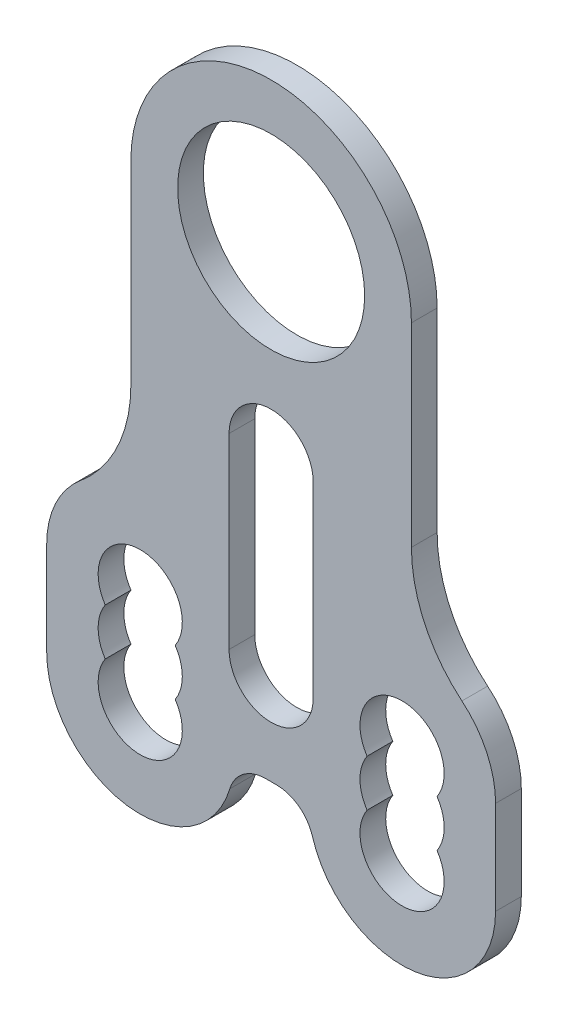
ISO-10303-21;
HEADER;
FILE_DESCRIPTION(('STEP AP214'),'2;1');
FILE_NAME('part.step','',(''),(''),'','','');
FILE_SCHEMA(('AUTOMOTIVE_DESIGN { 1 0 10303 214 1 1 1 1 }'));
ENDSEC;
DATA;
#1=APPLICATION_CONTEXT('core data for automotive mechanical design processes');
#2=APPLICATION_PROTOCOL_DEFINITION('international standard','automotive_design',2000,#1);
#3=PRODUCT_CONTEXT('',#1,'mechanical');
#4=PRODUCT('Part','Part','',(#3));
#5=PRODUCT_RELATED_PRODUCT_CATEGORY('part','',(#4));
#6=PRODUCT_DEFINITION_FORMATION('','',#4);
#7=PRODUCT_DEFINITION_CONTEXT('part definition',#1,'design');
#8=PRODUCT_DEFINITION('design','',#6,#7);
#9=PRODUCT_DEFINITION_SHAPE('','',#8);
#10=(LENGTH_UNIT() NAMED_UNIT(*) SI_UNIT(.MILLI.,.METRE.));
#11=(NAMED_UNIT(*) PLANE_ANGLE_UNIT() SI_UNIT($,.RADIAN.));
#12=(NAMED_UNIT(*) SI_UNIT($,.STERADIAN.) SOLID_ANGLE_UNIT());
#13=UNCERTAINTY_MEASURE_WITH_UNIT(LENGTH_MEASURE(1.E-05),#10,'distance_accuracy_value','');
#14=(GEOMETRIC_REPRESENTATION_CONTEXT(3) GLOBAL_UNCERTAINTY_ASSIGNED_CONTEXT((#13)) GLOBAL_UNIT_ASSIGNED_CONTEXT((#10,
#11,#12)) REPRESENTATION_CONTEXT('',''));
#15=CARTESIAN_POINT('',(0.,0.,0.));
#16=DIRECTION('',(0.,0.,1.));
#17=DIRECTION('',(1.,0.,0.));
#18=AXIS2_PLACEMENT_3D('',#15,#16,#17);
#19=CARTESIAN_POINT('',(0.583592135001261,-54.,2.75));
#20=DIRECTION('',(0.,0.,1.));
#21=DIRECTION('',(1.,0.,0.));
#22=AXIS2_PLACEMENT_3D('',#19,#20,#21);
#23=PLANE('',#22);
#24=CARTESIAN_POINT('',(0.583592135001261,-54.,2.75));
#25=DIRECTION('',(0.,0.,-1.));
#26=DIRECTION('',(1.,0.,0.));
#27=AXIS2_PLACEMENT_3D('',#24,#25,#26);
#28=CIRCLE('',#27,4.);
#29=CARTESIAN_POINT('',(0.583592135001261,-50.,2.75));
#30=VERTEX_POINT('',#29);
#31=CARTESIAN_POINT('',(4.4168515250009,-52.8571428571429,2.75));
#32=VERTEX_POINT('',#31);
#33=EDGE_CURVE('E314',#30,#32,#28,.T.);
#34=ORIENTED_EDGE('',*,*,#33,.T.);
#35=CARTESIAN_POINT('',(14.,-50.,2.75));
#36=DIRECTION('',(0.,0.,1.));
#37=DIRECTION('',(-1.,0.,0.));
#38=AXIS2_PLACEMENT_3D('',#35,#36,#37);
#39=CIRCLE('',#38,10.);
#40=CARTESIAN_POINT('',(24.,-50.0000000000001,2.75));
#41=VERTEX_POINT('',#40);
#42=EDGE_CURVE('E317',#32,#41,#39,.T.);
#43=ORIENTED_EDGE('',*,*,#42,.T.);
#44=DIRECTION('',(0.,1.,0.));
#45=VECTOR('',#44,1.);
#46=CARTESIAN_POINT('',(24.,-40.0000000000001,2.75));
#47=LINE('',#46,#45);
#48=CARTESIAN_POINT('',(24.,-40.0000000000001,2.75));
#49=VERTEX_POINT('',#48);
#50=EDGE_CURVE('E320',#41,#49,#47,.T.);
#51=ORIENTED_EDGE('',*,*,#50,.T.);
#52=CARTESIAN_POINT('',(14.,-40.,2.75));
#53=DIRECTION('',(0.,0.,1.));
#54=DIRECTION('',(-1.,0.,0.));
#55=AXIS2_PLACEMENT_3D('',#52,#53,#54);
#56=CIRCLE('',#55,10.);
#57=CARTESIAN_POINT('',(20.4,-32.3162509150806,2.75));
#58=VERTEX_POINT('',#57);
#59=EDGE_CURVE('E322',#49,#58,#56,.T.);
#60=ORIENTED_EDGE('',*,*,#59,.T.);
#61=CARTESIAN_POINT('',(30.,-20.7906272877015,2.75));
#62=DIRECTION('',(0.,0.,-1.));
#63=DIRECTION('',(-1.,0.,0.));
#64=AXIS2_PLACEMENT_3D('',#61,#62,#63);
#65=CIRCLE('',#64,15.);
#66=CARTESIAN_POINT('',(15.,-20.7906272877015,2.75));
#67=VERTEX_POINT('',#66);
#68=EDGE_CURVE('E324',#58,#67,#65,.T.);
#69=ORIENTED_EDGE('',*,*,#68,.T.);
#70=DIRECTION('',(0.,1.,0.));
#71=VECTOR('',#70,1.);
#72=CARTESIAN_POINT('',(15.,0.,2.75));
#73=LINE('',#72,#71);
#74=CARTESIAN_POINT('',(15.,0.,2.75));
#75=VERTEX_POINT('',#74);
#76=EDGE_CURVE('E326',#67,#75,#73,.T.);
#77=ORIENTED_EDGE('',*,*,#76,.T.);
#78=CARTESIAN_POINT('',(0.,0.,2.75));
#79=DIRECTION('',(0.,0.,1.));
#80=DIRECTION('',(1.,0.,0.));
#81=AXIS2_PLACEMENT_3D('',#78,#79,#80);
#82=CIRCLE('',#81,15.);
#83=CARTESIAN_POINT('',(-15.,0.,2.75));
#84=VERTEX_POINT('',#83);
#85=EDGE_CURVE('E328',#75,#84,#82,.T.);
#86=ORIENTED_EDGE('',*,*,#85,.T.);
#87=DIRECTION('',(0.,-1.,0.));
#88=VECTOR('',#87,1.);
#89=CARTESIAN_POINT('',(-15.,0.,2.75));
#90=LINE('',#89,#88);
#91=CARTESIAN_POINT('',(-15.,-20.7906272877015,2.75));
#92=VERTEX_POINT('',#91);
#93=EDGE_CURVE('E330',#84,#92,#90,.T.);
#94=ORIENTED_EDGE('',*,*,#93,.T.);
#95=CARTESIAN_POINT('',(-30.,-20.7906272877015,2.75));
#96=DIRECTION('',(0.,0.,-1.));
#97=DIRECTION('',(1.,0.,0.));
#98=AXIS2_PLACEMENT_3D('',#95,#96,#97);
#99=CIRCLE('',#98,15.);
#100=CARTESIAN_POINT('',(-20.4,-32.3162509150806,2.75));
#101=VERTEX_POINT('',#100);
#102=EDGE_CURVE('E332',#92,#101,#99,.T.);
#103=ORIENTED_EDGE('',*,*,#102,.T.);
#104=CARTESIAN_POINT('',(-14.,-40.,2.75));
#105=DIRECTION('',(0.,0.,1.));
#106=DIRECTION('',(1.,0.,0.));
#107=AXIS2_PLACEMENT_3D('',#104,#105,#106);
#108=CIRCLE('',#107,10.);
#109=CARTESIAN_POINT('',(-24.,-40.0000000000001,2.75));
#110=VERTEX_POINT('',#109);
#111=EDGE_CURVE('E334',#101,#110,#108,.T.);
#112=ORIENTED_EDGE('',*,*,#111,.T.);
#113=DIRECTION('',(0.,-1.,0.));
#114=VECTOR('',#113,1.);
#115=CARTESIAN_POINT('',(-24.,-40.0000000000001,2.75));
#116=LINE('',#115,#114);
#117=CARTESIAN_POINT('',(-24.,-50.0000000000001,2.75));
#118=VERTEX_POINT('',#117);
#119=EDGE_CURVE('E336',#110,#118,#116,.T.);
#120=ORIENTED_EDGE('',*,*,#119,.T.);
#121=CARTESIAN_POINT('',(-14.,-50.,2.75));
#122=DIRECTION('',(0.,0.,1.));
#123=DIRECTION('',(1.,0.,0.));
#124=AXIS2_PLACEMENT_3D('',#121,#122,#123);
#125=CIRCLE('',#124,10.);
#126=CARTESIAN_POINT('',(-4.4168515250009,-52.8571428571429,2.75));
#127=VERTEX_POINT('',#126);
#128=EDGE_CURVE('E338',#118,#127,#125,.T.);
#129=ORIENTED_EDGE('',*,*,#128,.T.);
#130=CARTESIAN_POINT('',(-0.583592135001261,-54.,2.75));
#131=DIRECTION('',(0.,0.,-1.));
#132=DIRECTION('',(-1.,0.,0.));
#133=AXIS2_PLACEMENT_3D('',#130,#131,#132);
#134=CIRCLE('',#133,4.);
#135=CARTESIAN_POINT('',(-0.583592135001261,-50.,2.75));
#136=VERTEX_POINT('',#135);
#137=EDGE_CURVE('E340',#127,#136,#134,.T.);
#138=ORIENTED_EDGE('',*,*,#137,.T.);
#139=DIRECTION('',(1.,0.,0.));
#140=VECTOR('',#139,1.);
#141=CARTESIAN_POINT('',(-0.583592135001261,-50.,2.75));
#142=LINE('',#141,#140);
#143=EDGE_CURVE('E342',#136,#30,#142,.T.);
#144=ORIENTED_EDGE('',*,*,#143,.T.);
#145=EDGE_LOOP('',(#34,#43,#51,#60,#69,#77,#86,#94,#103,#112,#120,#129,#138,#144));
#146=FACE_BOUND('',#145,.T.);
#147=CARTESIAN_POINT('',(0.,0.,2.75));
#148=DIRECTION('',(0.,0.,1.));
#149=DIRECTION('',(1.,0.,0.));
#150=AXIS2_PLACEMENT_3D('',#147,#148,#149);
#151=CIRCLE('',#150,10.);
#152=CARTESIAN_POINT('',(10.,0.,2.75));
#153=VERTEX_POINT('',#152);
#154=EDGE_CURVE('E308',#153,#153,#151,.T.);
#155=ORIENTED_EDGE('',*,*,#154,.F.);
#156=EDGE_LOOP('',(#155));
#157=FACE_BOUND('',#156,.T.);
#158=CARTESIAN_POINT('',(-14.,-40.,2.75));
#159=DIRECTION('',(0.,0.,1.));
#160=DIRECTION('',(1.,0.,0.));
#161=AXIS2_PLACEMENT_3D('',#158,#159,#160);
#162=CIRCLE('',#161,4.5);
#163=CARTESIAN_POINT('',(-10.2583426132261,-42.5,2.75));
#164=VERTEX_POINT('',#163);
#165=CARTESIAN_POINT('',(-17.7416573867739,-42.5,2.75));
#166=VERTEX_POINT('',#165);
#167=EDGE_CURVE('E279',#164,#166,#162,.T.);
#168=ORIENTED_EDGE('',*,*,#167,.F.);
#169=CARTESIAN_POINT('',(-14.,-45.,2.75));
#170=DIRECTION('',(0.,0.,1.));
#171=DIRECTION('',(1.,0.,0.));
#172=AXIS2_PLACEMENT_3D('',#169,#170,#171);
#173=CIRCLE('',#172,4.5);
#174=CARTESIAN_POINT('',(-10.2583426132261,-47.5,2.75));
#175=VERTEX_POINT('',#174);
#176=EDGE_CURVE('E277',#175,#164,#173,.T.);
#177=ORIENTED_EDGE('',*,*,#176,.F.);
#178=CARTESIAN_POINT('',(-14.,-50.,2.75));
#179=DIRECTION('',(0.,0.,1.));
#180=DIRECTION('',(1.,0.,0.));
#181=AXIS2_PLACEMENT_3D('',#178,#179,#180);
#182=CIRCLE('',#181,4.5);
#183=CARTESIAN_POINT('',(-17.7416573867739,-47.5,2.75));
#184=VERTEX_POINT('',#183);
#185=EDGE_CURVE('E285',#184,#175,#182,.T.);
#186=ORIENTED_EDGE('',*,*,#185,.F.);
#187=CARTESIAN_POINT('',(-14.,-45.,2.75));
#188=DIRECTION('',(0.,0.,1.));
#189=DIRECTION('',(1.,0.,0.));
#190=AXIS2_PLACEMENT_3D('',#187,#188,#189);
#191=CIRCLE('',#190,4.5);
#192=EDGE_CURVE('E282',#166,#184,#191,.T.);
#193=ORIENTED_EDGE('',*,*,#192,.F.);
#194=EDGE_LOOP('',(#168,#177,#186,#193));
#195=FACE_BOUND('',#194,.T.);
#196=CARTESIAN_POINT('',(14.,-45.,2.75));
#197=DIRECTION('',(0.,0.,1.));
#198=DIRECTION('',(-1.,0.,0.));
#199=AXIS2_PLACEMENT_3D('',#196,#197,#198);
#200=CIRCLE('',#199,4.5);
#201=CARTESIAN_POINT('',(17.7416573867739,-47.5,2.75));
#202=VERTEX_POINT('',#201);
#203=CARTESIAN_POINT('',(17.7416573867739,-42.5,2.75));
#204=VERTEX_POINT('',#203);
#205=EDGE_CURVE('E248',#202,#204,#200,.T.);
#206=ORIENTED_EDGE('',*,*,#205,.F.);
#207=CARTESIAN_POINT('',(14.,-50.,2.75));
#208=DIRECTION('',(0.,0.,1.));
#209=DIRECTION('',(-1.,0.,0.));
#210=AXIS2_PLACEMENT_3D('',#207,#208,#209);
#211=CIRCLE('',#210,4.5);
#212=CARTESIAN_POINT('',(10.2583426132261,-47.5,2.75));
#213=VERTEX_POINT('',#212);
#214=EDGE_CURVE('E246',#213,#202,#211,.T.);
#215=ORIENTED_EDGE('',*,*,#214,.F.);
#216=CARTESIAN_POINT('',(14.,-45.,2.75));
#217=DIRECTION('',(0.,0.,1.));
#218=DIRECTION('',(-1.,0.,0.));
#219=AXIS2_PLACEMENT_3D('',#216,#217,#218);
#220=CIRCLE('',#219,4.5);
#221=CARTESIAN_POINT('',(10.2583426132261,-42.5,2.75));
#222=VERTEX_POINT('',#221);
#223=EDGE_CURVE('E254',#222,#213,#220,.T.);
#224=ORIENTED_EDGE('',*,*,#223,.F.);
#225=CARTESIAN_POINT('',(14.,-40.,2.75));
#226=DIRECTION('',(0.,0.,1.));
#227=DIRECTION('',(-1.,0.,0.));
#228=AXIS2_PLACEMENT_3D('',#225,#226,#227);
#229=CIRCLE('',#228,4.5);
#230=EDGE_CURVE('E251',#204,#222,#229,.T.);
#231=ORIENTED_EDGE('',*,*,#230,.F.);
#232=EDGE_LOOP('',(#206,#215,#224,#231));
#233=FACE_BOUND('',#232,.T.);
#234=DIRECTION('',(0.,-1.,0.));
#235=VECTOR('',#234,1.);
#236=CARTESIAN_POINT('',(-4.5,-20.,2.75));
#237=LINE('',#236,#235);
#238=CARTESIAN_POINT('',(-4.5,-20.,2.75));
#239=VERTEX_POINT('',#238);
#240=CARTESIAN_POINT('',(-4.5,-40.,2.75));
#241=VERTEX_POINT('',#240);
#242=EDGE_CURVE('E218',#239,#241,#237,.T.);
#243=ORIENTED_EDGE('',*,*,#242,.F.);
#244=CARTESIAN_POINT('',(0.,-20.,2.75));
#245=DIRECTION('',(0.,0.,1.));
#246=DIRECTION('',(1.,0.,0.));
#247=AXIS2_PLACEMENT_3D('',#244,#245,#246);
#248=CIRCLE('',#247,4.5);
#249=CARTESIAN_POINT('',(4.5,-20.,2.75));
#250=VERTEX_POINT('',#249);
#251=EDGE_CURVE('E210',#250,#239,#248,.T.);
#252=ORIENTED_EDGE('',*,*,#251,.F.);
#253=DIRECTION('',(0.,1.,0.));
#254=VECTOR('',#253,1.);
#255=CARTESIAN_POINT('',(4.5,-20.,2.75));
#256=LINE('',#255,#254);
#257=CARTESIAN_POINT('',(4.5,-40.,2.75));
#258=VERTEX_POINT('',#257);
#259=EDGE_CURVE('E232',#258,#250,#256,.T.);
#260=ORIENTED_EDGE('',*,*,#259,.F.);
#261=CARTESIAN_POINT('',(0.,-40.,2.75));
#262=DIRECTION('',(0.,0.,1.));
#263=DIRECTION('',(1.,0.,0.));
#264=AXIS2_PLACEMENT_3D('',#261,#262,#263);
#265=CIRCLE('',#264,4.5);
#266=EDGE_CURVE('E230',#241,#258,#265,.T.);
#267=ORIENTED_EDGE('',*,*,#266,.F.);
#268=EDGE_LOOP('',(#243,#252,#260,#267));
#269=FACE_BOUND('',#268,.T.);
#270=ADVANCED_FACE('F37',(#146,#157,#195,#233,#269),#23,.T.);
#271=CARTESIAN_POINT('',(0.583592135001261,-54.,0.));
#272=DIRECTION('',(0.,0.,1.));
#273=DIRECTION('',(1.,0.,0.));
#274=AXIS2_PLACEMENT_3D('',#271,#272,#273);
#275=PLANE('',#274);
#276=CARTESIAN_POINT('',(14.,-50.,0.));
#277=DIRECTION('',(0.,0.,1.));
#278=DIRECTION('',(-1.,0.,0.));
#279=AXIS2_PLACEMENT_3D('',#276,#277,#278);
#280=CIRCLE('',#279,4.5);
#281=CARTESIAN_POINT('',(10.2583426132261,-47.5,0.));
#282=VERTEX_POINT('',#281);
#283=CARTESIAN_POINT('',(17.7416573867739,-47.5,0.));
#284=VERTEX_POINT('',#283);
#285=EDGE_CURVE('E226',#282,#284,#280,.T.);
#286=ORIENTED_EDGE('',*,*,#285,.T.);
#287=CARTESIAN_POINT('',(14.,-45.,0.));
#288=DIRECTION('',(0.,0.,1.));
#289=DIRECTION('',(-1.,0.,0.));
#290=AXIS2_PLACEMENT_3D('',#287,#288,#289);
#291=CIRCLE('',#290,4.5);
#292=CARTESIAN_POINT('',(17.7416573867739,-42.5,0.));
#293=VERTEX_POINT('',#292);
#294=EDGE_CURVE('E259',#284,#293,#291,.T.);
#295=ORIENTED_EDGE('',*,*,#294,.T.);
#296=CARTESIAN_POINT('',(14.,-40.,0.));
#297=DIRECTION('',(0.,0.,1.));
#298=DIRECTION('',(-1.,0.,0.));
#299=AXIS2_PLACEMENT_3D('',#296,#297,#298);
#300=CIRCLE('',#299,4.5);
#301=CARTESIAN_POINT('',(10.2583426132261,-42.5,0.));
#302=VERTEX_POINT('',#301);
#303=EDGE_CURVE('E262',#293,#302,#300,.T.);
#304=ORIENTED_EDGE('',*,*,#303,.T.);
#305=CARTESIAN_POINT('',(14.,-45.,0.));
#306=DIRECTION('',(0.,0.,1.));
#307=DIRECTION('',(-1.,0.,0.));
#308=AXIS2_PLACEMENT_3D('',#305,#306,#307);
#309=CIRCLE('',#308,4.5);
#310=EDGE_CURVE('E249',#302,#282,#309,.T.);
#311=ORIENTED_EDGE('',*,*,#310,.T.);
#312=EDGE_LOOP('',(#286,#295,#304,#311));
#313=FACE_BOUND('',#312,.T.);
#314=CARTESIAN_POINT('',(0.,0.,0.));
#315=DIRECTION('',(0.,0.,1.));
#316=DIRECTION('',(1.,0.,0.));
#317=AXIS2_PLACEMENT_3D('',#314,#315,#316);
#318=CIRCLE('',#317,10.);
#319=CARTESIAN_POINT('',(10.,0.,0.));
#320=VERTEX_POINT('',#319);
#321=EDGE_CURVE('E307',#320,#320,#318,.T.);
#322=ORIENTED_EDGE('',*,*,#321,.T.);
#323=EDGE_LOOP('',(#322));
#324=FACE_BOUND('',#323,.T.);
#325=CARTESIAN_POINT('',(0.583592135001261,-54.,0.));
#326=DIRECTION('',(0.,0.,-1.));
#327=DIRECTION('',(1.,0.,0.));
#328=AXIS2_PLACEMENT_3D('',#325,#326,#327);
#329=CIRCLE('',#328,4.);
#330=CARTESIAN_POINT('',(0.583592135001261,-50.,0.));
#331=VERTEX_POINT('',#330);
#332=CARTESIAN_POINT('',(4.4168515250009,-52.8571428571429,0.));
#333=VERTEX_POINT('',#332);
#334=EDGE_CURVE('E311',#331,#333,#329,.T.);
#335=ORIENTED_EDGE('',*,*,#334,.F.);
#336=DIRECTION('',(1.,0.,0.));
#337=VECTOR('',#336,1.);
#338=CARTESIAN_POINT('',(-0.583592135001261,-50.,0.));
#339=LINE('',#338,#337);
#340=CARTESIAN_POINT('',(-0.583592135001261,-50.,0.));
#341=VERTEX_POINT('',#340);
#342=EDGE_CURVE('E318',#341,#331,#339,.T.);
#343=ORIENTED_EDGE('',*,*,#342,.F.);
#344=CARTESIAN_POINT('',(-0.583592135001261,-54.,0.));
#345=DIRECTION('',(0.,0.,-1.));
#346=DIRECTION('',(-1.,0.,0.));
#347=AXIS2_PLACEMENT_3D('',#344,#345,#346);
#348=CIRCLE('',#347,4.);
#349=CARTESIAN_POINT('',(-4.4168515250009,-52.8571428571429,0.));
#350=VERTEX_POINT('',#349);
#351=EDGE_CURVE('E369',#350,#341,#348,.T.);
#352=ORIENTED_EDGE('',*,*,#351,.F.);
#353=CARTESIAN_POINT('',(-14.,-50.,0.));
#354=DIRECTION('',(0.,0.,1.));
#355=DIRECTION('',(1.,0.,0.));
#356=AXIS2_PLACEMENT_3D('',#353,#354,#355);
#357=CIRCLE('',#356,10.);
#358=CARTESIAN_POINT('',(-24.,-50.0000000000001,0.));
#359=VERTEX_POINT('',#358);
#360=EDGE_CURVE('E367',#359,#350,#357,.T.);
#361=ORIENTED_EDGE('',*,*,#360,.F.);
#362=DIRECTION('',(0.,-1.,0.));
#363=VECTOR('',#362,1.);
#364=CARTESIAN_POINT('',(-24.,-40.0000000000001,0.));
#365=LINE('',#364,#363);
#366=CARTESIAN_POINT('',(-24.,-40.0000000000001,0.));
#367=VERTEX_POINT('',#366);
#368=EDGE_CURVE('E365',#367,#359,#365,.T.);
#369=ORIENTED_EDGE('',*,*,#368,.F.);
#370=CARTESIAN_POINT('',(-14.,-40.,0.));
#371=DIRECTION('',(0.,0.,1.));
#372=DIRECTION('',(1.,0.,0.));
#373=AXIS2_PLACEMENT_3D('',#370,#371,#372);
#374=CIRCLE('',#373,10.);
#375=CARTESIAN_POINT('',(-20.4,-32.3162509150806,0.));
#376=VERTEX_POINT('',#375);
#377=EDGE_CURVE('E363',#376,#367,#374,.T.);
#378=ORIENTED_EDGE('',*,*,#377,.F.);
#379=CARTESIAN_POINT('',(-30.,-20.7906272877015,0.));
#380=DIRECTION('',(0.,0.,-1.));
#381=DIRECTION('',(1.,0.,0.));
#382=AXIS2_PLACEMENT_3D('',#379,#380,#381);
#383=CIRCLE('',#382,15.);
#384=CARTESIAN_POINT('',(-15.,-20.7906272877015,0.));
#385=VERTEX_POINT('',#384);
#386=EDGE_CURVE('E361',#385,#376,#383,.T.);
#387=ORIENTED_EDGE('',*,*,#386,.F.);
#388=DIRECTION('',(0.,-1.,0.));
#389=VECTOR('',#388,1.);
#390=CARTESIAN_POINT('',(-15.,0.,0.));
#391=LINE('',#390,#389);
#392=CARTESIAN_POINT('',(-15.,0.,0.));
#393=VERTEX_POINT('',#392);
#394=EDGE_CURVE('E359',#393,#385,#391,.T.);
#395=ORIENTED_EDGE('',*,*,#394,.F.);
#396=CARTESIAN_POINT('',(0.,0.,0.));
#397=DIRECTION('',(0.,0.,1.));
#398=DIRECTION('',(1.,0.,0.));
#399=AXIS2_PLACEMENT_3D('',#396,#397,#398);
#400=CIRCLE('',#399,15.);
#401=CARTESIAN_POINT('',(15.,0.,0.));
#402=VERTEX_POINT('',#401);
#403=EDGE_CURVE('E357',#402,#393,#400,.T.);
#404=ORIENTED_EDGE('',*,*,#403,.F.);
#405=DIRECTION('',(0.,1.,0.));
#406=VECTOR('',#405,1.);
#407=CARTESIAN_POINT('',(15.,0.,0.));
#408=LINE('',#407,#406);
#409=CARTESIAN_POINT('',(15.,-20.7906272877015,0.));
#410=VERTEX_POINT('',#409);
#411=EDGE_CURVE('E355',#410,#402,#408,.T.);
#412=ORIENTED_EDGE('',*,*,#411,.F.);
#413=CARTESIAN_POINT('',(30.,-20.7906272877015,0.));
#414=DIRECTION('',(0.,0.,-1.));
#415=DIRECTION('',(-1.,0.,0.));
#416=AXIS2_PLACEMENT_3D('',#413,#414,#415);
#417=CIRCLE('',#416,15.);
#418=CARTESIAN_POINT('',(20.4,-32.3162509150806,0.));
#419=VERTEX_POINT('',#418);
#420=EDGE_CURVE('E353',#419,#410,#417,.T.);
#421=ORIENTED_EDGE('',*,*,#420,.F.);
#422=CARTESIAN_POINT('',(14.,-40.,0.));
#423=DIRECTION('',(0.,0.,1.));
#424=DIRECTION('',(-1.,0.,0.));
#425=AXIS2_PLACEMENT_3D('',#422,#423,#424);
#426=CIRCLE('',#425,10.);
#427=CARTESIAN_POINT('',(24.,-40.0000000000001,0.));
#428=VERTEX_POINT('',#427);
#429=EDGE_CURVE('E351',#428,#419,#426,.T.);
#430=ORIENTED_EDGE('',*,*,#429,.F.);
#431=DIRECTION('',(0.,1.,0.));
#432=VECTOR('',#431,1.);
#433=CARTESIAN_POINT('',(24.,-40.0000000000001,0.));
#434=LINE('',#433,#432);
#435=CARTESIAN_POINT('',(24.,-50.0000000000001,0.));
#436=VERTEX_POINT('',#435);
#437=EDGE_CURVE('E349',#436,#428,#434,.T.);
#438=ORIENTED_EDGE('',*,*,#437,.F.);
#439=CARTESIAN_POINT('',(14.,-50.,0.));
#440=DIRECTION('',(0.,0.,1.));
#441=DIRECTION('',(-1.,0.,0.));
#442=AXIS2_PLACEMENT_3D('',#439,#440,#441);
#443=CIRCLE('',#442,10.);
#444=EDGE_CURVE('E347',#333,#436,#443,.T.);
#445=ORIENTED_EDGE('',*,*,#444,.F.);
#446=EDGE_LOOP('',(#335,#343,#352,#361,#369,#378,#387,#395,#404,#412,#421,#430,#438,#445));
#447=FACE_BOUND('',#446,.T.);
#448=CARTESIAN_POINT('',(-14.,-45.,0.));
#449=DIRECTION('',(0.,0.,1.));
#450=DIRECTION('',(1.,0.,0.));
#451=AXIS2_PLACEMENT_3D('',#448,#449,#450);
#452=CIRCLE('',#451,4.5);
#453=CARTESIAN_POINT('',(-10.2583426132261,-47.5,0.));
#454=VERTEX_POINT('',#453);
#455=CARTESIAN_POINT('',(-10.2583426132261,-42.5,0.));
#456=VERTEX_POINT('',#455);
#457=EDGE_CURVE('E276',#454,#456,#452,.T.);
#458=ORIENTED_EDGE('',*,*,#457,.T.);
#459=CARTESIAN_POINT('',(-14.,-40.,0.));
#460=DIRECTION('',(0.,0.,1.));
#461=DIRECTION('',(1.,0.,0.));
#462=AXIS2_PLACEMENT_3D('',#459,#460,#461);
#463=CIRCLE('',#462,4.5);
#464=CARTESIAN_POINT('',(-17.7416573867739,-42.5,0.));
#465=VERTEX_POINT('',#464);
#466=EDGE_CURVE('E290',#456,#465,#463,.T.);
#467=ORIENTED_EDGE('',*,*,#466,.T.);
#468=CARTESIAN_POINT('',(-14.,-45.,0.));
#469=DIRECTION('',(0.,0.,1.));
#470=DIRECTION('',(1.,0.,0.));
#471=AXIS2_PLACEMENT_3D('',#468,#469,#470);
#472=CIRCLE('',#471,4.5);
#473=CARTESIAN_POINT('',(-17.7416573867739,-47.5,0.));
#474=VERTEX_POINT('',#473);
#475=EDGE_CURVE('E293',#465,#474,#472,.T.);
#476=ORIENTED_EDGE('',*,*,#475,.T.);
#477=CARTESIAN_POINT('',(-14.,-50.,0.));
#478=DIRECTION('',(0.,0.,1.));
#479=DIRECTION('',(1.,0.,0.));
#480=AXIS2_PLACEMENT_3D('',#477,#478,#479);
#481=CIRCLE('',#480,4.5);
#482=EDGE_CURVE('E280',#474,#454,#481,.T.);
#483=ORIENTED_EDGE('',*,*,#482,.T.);
#484=EDGE_LOOP('',(#458,#467,#476,#483));
#485=FACE_BOUND('',#484,.T.);
#486=CARTESIAN_POINT('',(0.,-20.,0.));
#487=DIRECTION('',(0.,0.,1.));
#488=DIRECTION('',(1.,0.,0.));
#489=AXIS2_PLACEMENT_3D('',#486,#487,#488);
#490=CIRCLE('',#489,4.5);
#491=CARTESIAN_POINT('',(4.5,-20.,0.));
#492=VERTEX_POINT('',#491);
#493=CARTESIAN_POINT('',(-4.5,-20.,0.));
#494=VERTEX_POINT('',#493);
#495=EDGE_CURVE('E60',#492,#494,#490,.T.);
#496=ORIENTED_EDGE('',*,*,#495,.T.);
#497=DIRECTION('',(0.,-1.,0.));
#498=VECTOR('',#497,1.);
#499=CARTESIAN_POINT('',(-4.5,-20.,0.));
#500=LINE('',#499,#498);
#501=CARTESIAN_POINT('',(-4.5,-40.,0.));
#502=VERTEX_POINT('',#501);
#503=EDGE_CURVE('E225',#494,#502,#500,.T.);
#504=ORIENTED_EDGE('',*,*,#503,.T.);
#505=CARTESIAN_POINT('',(0.,-40.,0.));
#506=DIRECTION('',(0.,0.,1.));
#507=DIRECTION('',(1.,0.,0.));
#508=AXIS2_PLACEMENT_3D('',#505,#506,#507);
#509=CIRCLE('',#508,4.5);
#510=CARTESIAN_POINT('',(4.5,-40.,0.));
#511=VERTEX_POINT('',#510);
#512=EDGE_CURVE('E238',#502,#511,#509,.T.);
#513=ORIENTED_EDGE('',*,*,#512,.T.);
#514=DIRECTION('',(0.,1.,0.));
#515=VECTOR('',#514,1.);
#516=CARTESIAN_POINT('',(4.5,-20.,0.));
#517=LINE('',#516,#515);
#518=EDGE_CURVE('E219',#511,#492,#517,.T.);
#519=ORIENTED_EDGE('',*,*,#518,.T.);
#520=EDGE_LOOP('',(#496,#504,#513,#519));
#521=FACE_BOUND('',#520,.T.);
#522=ADVANCED_FACE('F417',(#313,#324,#447,#485,#521),#275,.F.);
#523=CARTESIAN_POINT('',(0.583592135001261,-54.,2.75));
#524=DIRECTION('',(0.,0.,-1.));
#525=DIRECTION('',(-1.,0.,0.));
#526=AXIS2_PLACEMENT_3D('',#523,#524,#525);
#527=CYLINDRICAL_SURFACE('',#526,4.);
#528=ORIENTED_EDGE('',*,*,#334,.T.);
#529=DIRECTION('',(0.,0.,-1.));
#530=VECTOR('',#529,1.);
#531=CARTESIAN_POINT('',(4.4168515250009,-52.8571428571429,2.75));
#532=LINE('',#531,#530);
#533=EDGE_CURVE('E11',#32,#333,#532,.T.);
#534=ORIENTED_EDGE('',*,*,#533,.F.);
#535=ORIENTED_EDGE('',*,*,#33,.F.);
#536=DIRECTION('',(0.,0.,-1.));
#537=VECTOR('',#536,1.);
#538=CARTESIAN_POINT('',(0.583592135001261,-50.,2.75));
#539=LINE('',#538,#537);
#540=EDGE_CURVE('E344',#30,#331,#539,.T.);
#541=ORIENTED_EDGE('',*,*,#540,.T.);
#542=EDGE_LOOP('',(#528,#534,#535,#541));
#543=FACE_BOUND('',#542,.T.);
#544=ADVANCED_FACE('F39',(#543),#527,.F.);
#545=CARTESIAN_POINT('',(14.,-50.,2.75));
#546=DIRECTION('',(0.,0.,-1.));
#547=DIRECTION('',(-1.,0.,0.));
#548=AXIS2_PLACEMENT_3D('',#545,#546,#547);
#549=CYLINDRICAL_SURFACE('',#548,10.);
#550=ORIENTED_EDGE('',*,*,#444,.T.);
#551=DIRECTION('',(0.,0.,-1.));
#552=VECTOR('',#551,1.);
#553=CARTESIAN_POINT('',(24.,-50.0000000000001,2.75));
#554=LINE('',#553,#552);
#555=EDGE_CURVE('E45',#41,#436,#554,.T.);
#556=ORIENTED_EDGE('',*,*,#555,.F.);
#557=ORIENTED_EDGE('',*,*,#42,.F.);
#558=ORIENTED_EDGE('',*,*,#533,.T.);
#559=EDGE_LOOP('',(#550,#556,#557,#558));
#560=FACE_BOUND('',#559,.T.);
#561=ADVANCED_FACE('F435',(#560),#549,.T.);
#562=CARTESIAN_POINT('',(24.,-40.0000000000001,2.75));
#563=DIRECTION('',(-1.,0.,0.));
#564=DIRECTION('',(0.,0.,1.));
#565=AXIS2_PLACEMENT_3D('',#562,#563,#564);
#566=PLANE('',#565);
#567=ORIENTED_EDGE('',*,*,#437,.T.);
#568=DIRECTION('',(0.,0.,-1.));
#569=VECTOR('',#568,1.);
#570=CARTESIAN_POINT('',(24.,-40.0000000000001,2.75));
#571=LINE('',#570,#569);
#572=EDGE_CURVE('E404',#49,#428,#571,.T.);
#573=ORIENTED_EDGE('',*,*,#572,.F.);
#574=ORIENTED_EDGE('',*,*,#50,.F.);
#575=ORIENTED_EDGE('',*,*,#555,.T.);
#576=EDGE_LOOP('',(#567,#573,#574,#575));
#577=FACE_BOUND('',#576,.T.);
#578=ADVANCED_FACE('F411',(#577),#566,.F.);
#579=CARTESIAN_POINT('',(14.,-40.,2.75));
#580=DIRECTION('',(0.,0.,-1.));
#581=DIRECTION('',(-1.,0.,0.));
#582=AXIS2_PLACEMENT_3D('',#579,#580,#581);
#583=CYLINDRICAL_SURFACE('',#582,10.);
#584=ORIENTED_EDGE('',*,*,#429,.T.);
#585=DIRECTION('',(0.,0.,-1.));
#586=VECTOR('',#585,1.);
#587=CARTESIAN_POINT('',(20.4,-32.3162509150806,2.75));
#588=LINE('',#587,#586);
#589=EDGE_CURVE('E401',#58,#419,#588,.T.);
#590=ORIENTED_EDGE('',*,*,#589,.F.);
#591=ORIENTED_EDGE('',*,*,#59,.F.);
#592=ORIENTED_EDGE('',*,*,#572,.T.);
#593=EDGE_LOOP('',(#584,#590,#591,#592));
#594=FACE_BOUND('',#593,.T.);
#595=ADVANCED_FACE('F423',(#594),#583,.T.);
#596=CARTESIAN_POINT('',(30.,-20.7906272877015,2.75));
#597=DIRECTION('',(0.,0.,-1.));
#598=DIRECTION('',(-1.,0.,0.));
#599=AXIS2_PLACEMENT_3D('',#596,#597,#598);
#600=CYLINDRICAL_SURFACE('',#599,15.);
#601=ORIENTED_EDGE('',*,*,#420,.T.);
#602=DIRECTION('',(0.,0.,-1.));
#603=VECTOR('',#602,1.);
#604=CARTESIAN_POINT('',(15.,-20.7906272877015,2.75));
#605=LINE('',#604,#603);
#606=EDGE_CURVE('E398',#67,#410,#605,.T.);
#607=ORIENTED_EDGE('',*,*,#606,.F.);
#608=ORIENTED_EDGE('',*,*,#68,.F.);
#609=ORIENTED_EDGE('',*,*,#589,.T.);
#610=EDGE_LOOP('',(#601,#607,#608,#609));
#611=FACE_BOUND('',#610,.T.);
#612=ADVANCED_FACE('F427',(#611),#600,.F.);
#613=CARTESIAN_POINT('',(15.,0.,2.75));
#614=DIRECTION('',(-1.,0.,0.));
#615=DIRECTION('',(0.,0.,1.));
#616=AXIS2_PLACEMENT_3D('',#613,#614,#615);
#617=PLANE('',#616);
#618=ORIENTED_EDGE('',*,*,#411,.T.);
#619=DIRECTION('',(0.,0.,-1.));
#620=VECTOR('',#619,1.);
#621=CARTESIAN_POINT('',(15.,0.,2.75));
#622=LINE('',#621,#620);
#623=EDGE_CURVE('E395',#75,#402,#622,.T.);
#624=ORIENTED_EDGE('',*,*,#623,.F.);
#625=ORIENTED_EDGE('',*,*,#76,.F.);
#626=ORIENTED_EDGE('',*,*,#606,.T.);
#627=EDGE_LOOP('',(#618,#624,#625,#626));
#628=FACE_BOUND('',#627,.T.);
#629=ADVANCED_FACE('F478',(#628),#617,.F.);
#630=CARTESIAN_POINT('',(0.,0.,2.75));
#631=DIRECTION('',(0.,0.,-1.));
#632=DIRECTION('',(-1.,0.,0.));
#633=AXIS2_PLACEMENT_3D('',#630,#631,#632);
#634=CYLINDRICAL_SURFACE('',#633,15.);
#635=ORIENTED_EDGE('',*,*,#403,.T.);
#636=DIRECTION('',(0.,0.,-1.));
#637=VECTOR('',#636,1.);
#638=CARTESIAN_POINT('',(-15.,0.,2.75));
#639=LINE('',#638,#637);
#640=EDGE_CURVE('E392',#84,#393,#639,.T.);
#641=ORIENTED_EDGE('',*,*,#640,.F.);
#642=ORIENTED_EDGE('',*,*,#85,.F.);
#643=ORIENTED_EDGE('',*,*,#623,.T.);
#644=EDGE_LOOP('',(#635,#641,#642,#643));
#645=FACE_BOUND('',#644,.T.);
#646=ADVANCED_FACE('F476',(#645),#634,.T.);
#647=CARTESIAN_POINT('',(-15.,0.,2.75));
#648=DIRECTION('',(1.,0.,0.));
#649=DIRECTION('',(0.,0.,-1.));
#650=AXIS2_PLACEMENT_3D('',#647,#648,#649);
#651=PLANE('',#650);
#652=ORIENTED_EDGE('',*,*,#394,.T.);
#653=DIRECTION('',(0.,0.,-1.));
#654=VECTOR('',#653,1.);
#655=CARTESIAN_POINT('',(-15.,-20.7906272877015,2.75));
#656=LINE('',#655,#654);
#657=EDGE_CURVE('E389',#92,#385,#656,.T.);
#658=ORIENTED_EDGE('',*,*,#657,.F.);
#659=ORIENTED_EDGE('',*,*,#93,.F.);
#660=ORIENTED_EDGE('',*,*,#640,.T.);
#661=EDGE_LOOP('',(#652,#658,#659,#660));
#662=FACE_BOUND('',#661,.T.);
#663=ADVANCED_FACE('F471',(#662),#651,.F.);
#664=CARTESIAN_POINT('',(-30.,-20.7906272877015,2.75));
#665=DIRECTION('',(0.,0.,-1.));
#666=DIRECTION('',(-1.,0.,0.));
#667=AXIS2_PLACEMENT_3D('',#664,#665,#666);
#668=CYLINDRICAL_SURFACE('',#667,15.);
#669=ORIENTED_EDGE('',*,*,#386,.T.);
#670=DIRECTION('',(0.,0.,-1.));
#671=VECTOR('',#670,1.);
#672=CARTESIAN_POINT('',(-20.4,-32.3162509150806,2.75));
#673=LINE('',#672,#671);
#674=EDGE_CURVE('E386',#101,#376,#673,.T.);
#675=ORIENTED_EDGE('',*,*,#674,.F.);
#676=ORIENTED_EDGE('',*,*,#102,.F.);
#677=ORIENTED_EDGE('',*,*,#657,.T.);
#678=EDGE_LOOP('',(#669,#675,#676,#677));
#679=FACE_BOUND('',#678,.T.);
#680=ADVANCED_FACE('F466',(#679),#668,.F.);
#681=CARTESIAN_POINT('',(-14.,-40.,2.75));
#682=DIRECTION('',(0.,0.,-1.));
#683=DIRECTION('',(-1.,0.,0.));
#684=AXIS2_PLACEMENT_3D('',#681,#682,#683);
#685=CYLINDRICAL_SURFACE('',#684,10.);
#686=ORIENTED_EDGE('',*,*,#377,.T.);
#687=DIRECTION('',(0.,0.,-1.));
#688=VECTOR('',#687,1.);
#689=CARTESIAN_POINT('',(-24.,-40.0000000000001,2.75));
#690=LINE('',#689,#688);
#691=EDGE_CURVE('E383',#110,#367,#690,.T.);
#692=ORIENTED_EDGE('',*,*,#691,.F.);
#693=ORIENTED_EDGE('',*,*,#111,.F.);
#694=ORIENTED_EDGE('',*,*,#674,.T.);
#695=EDGE_LOOP('',(#686,#692,#693,#694));
#696=FACE_BOUND('',#695,.T.);
#697=ADVANCED_FACE('F462',(#696),#685,.T.);
#698=CARTESIAN_POINT('',(-24.,-40.0000000000001,2.75));
#699=DIRECTION('',(1.,0.,0.));
#700=DIRECTION('',(0.,0.,-1.));
#701=AXIS2_PLACEMENT_3D('',#698,#699,#700);
#702=PLANE('',#701);
#703=ORIENTED_EDGE('',*,*,#368,.T.);
#704=DIRECTION('',(0.,0.,-1.));
#705=VECTOR('',#704,1.);
#706=CARTESIAN_POINT('',(-24.,-50.0000000000001,2.75));
#707=LINE('',#706,#705);
#708=EDGE_CURVE('E380',#118,#359,#707,.T.);
#709=ORIENTED_EDGE('',*,*,#708,.F.);
#710=ORIENTED_EDGE('',*,*,#119,.F.);
#711=ORIENTED_EDGE('',*,*,#691,.T.);
#712=EDGE_LOOP('',(#703,#709,#710,#711));
#713=FACE_BOUND('',#712,.T.);
#714=ADVANCED_FACE('F457',(#713),#702,.F.);
#715=CARTESIAN_POINT('',(-14.,-50.,2.75));
#716=DIRECTION('',(0.,0.,-1.));
#717=DIRECTION('',(-1.,0.,0.));
#718=AXIS2_PLACEMENT_3D('',#715,#716,#717);
#719=CYLINDRICAL_SURFACE('',#718,10.);
#720=ORIENTED_EDGE('',*,*,#360,.T.);
#721=DIRECTION('',(0.,0.,-1.));
#722=VECTOR('',#721,1.);
#723=CARTESIAN_POINT('',(-4.4168515250009,-52.8571428571429,2.75));
#724=LINE('',#723,#722);
#725=EDGE_CURVE('E377',#127,#350,#724,.T.);
#726=ORIENTED_EDGE('',*,*,#725,.F.);
#727=ORIENTED_EDGE('',*,*,#128,.F.);
#728=ORIENTED_EDGE('',*,*,#708,.T.);
#729=EDGE_LOOP('',(#720,#726,#727,#728));
#730=FACE_BOUND('',#729,.T.);
#731=ADVANCED_FACE('F451',(#730),#719,.T.);
#732=CARTESIAN_POINT('',(-0.583592135001261,-54.,2.75));
#733=DIRECTION('',(0.,0.,-1.));
#734=DIRECTION('',(-1.,0.,0.));
#735=AXIS2_PLACEMENT_3D('',#732,#733,#734);
#736=CYLINDRICAL_SURFACE('',#735,4.);
#737=ORIENTED_EDGE('',*,*,#351,.T.);
#738=DIRECTION('',(0.,0.,-1.));
#739=VECTOR('',#738,1.);
#740=CARTESIAN_POINT('',(-0.583592135001261,-50.,2.75));
#741=LINE('',#740,#739);
#742=EDGE_CURVE('E374',#136,#341,#741,.T.);
#743=ORIENTED_EDGE('',*,*,#742,.F.);
#744=ORIENTED_EDGE('',*,*,#137,.F.);
#745=ORIENTED_EDGE('',*,*,#725,.T.);
#746=EDGE_LOOP('',(#737,#743,#744,#745));
#747=FACE_BOUND('',#746,.T.);
#748=ADVANCED_FACE('F447',(#747),#736,.F.);
#749=CARTESIAN_POINT('',(-0.583592135001261,-50.,2.75));
#750=DIRECTION('',(0.,1.,0.));
#751=DIRECTION('',(0.,0.,1.));
#752=AXIS2_PLACEMENT_3D('',#749,#750,#751);
#753=PLANE('',#752);
#754=ORIENTED_EDGE('',*,*,#342,.T.);
#755=ORIENTED_EDGE('',*,*,#540,.F.);
#756=ORIENTED_EDGE('',*,*,#143,.F.);
#757=ORIENTED_EDGE('',*,*,#742,.T.);
#758=EDGE_LOOP('',(#754,#755,#756,#757));
#759=FACE_BOUND('',#758,.T.);
#760=ADVANCED_FACE('F442',(#759),#753,.F.);
#761=CARTESIAN_POINT('',(0.,0.,2.75));
#762=DIRECTION('',(0.,0.,-1.));
#763=DIRECTION('',(-1.,0.,0.));
#764=AXIS2_PLACEMENT_3D('',#761,#762,#763);
#765=CYLINDRICAL_SURFACE('',#764,10.);
#766=ORIENTED_EDGE('',*,*,#154,.T.);
#767=EDGE_LOOP('',(#766));
#768=FACE_BOUND('',#767,.T.);
#769=ORIENTED_EDGE('',*,*,#321,.F.);
#770=EDGE_LOOP('',(#769));
#771=FACE_BOUND('',#770,.T.);
#772=ADVANCED_FACE('F495',(#768,#771),#765,.F.);
#773=CARTESIAN_POINT('',(-14.,-45.,2.75));
#774=DIRECTION('',(0.,0.,-1.));
#775=DIRECTION('',(-1.,0.,0.));
#776=AXIS2_PLACEMENT_3D('',#773,#774,#775);
#777=CYLINDRICAL_SURFACE('',#776,4.5);
#778=ORIENTED_EDGE('',*,*,#457,.F.);
#779=DIRECTION('',(0.,0.,-1.));
#780=VECTOR('',#779,1.);
#781=CARTESIAN_POINT('',(-10.2583426132261,-47.5,2.75));
#782=LINE('',#781,#780);
#783=EDGE_CURVE('E287',#175,#454,#782,.T.);
#784=ORIENTED_EDGE('',*,*,#783,.F.);
#785=ORIENTED_EDGE('',*,*,#176,.T.);
#786=DIRECTION('',(0.,0.,-1.));
#787=VECTOR('',#786,1.);
#788=CARTESIAN_POINT('',(-10.2583426132261,-42.5,2.75));
#789=LINE('',#788,#787);
#790=EDGE_CURVE('E304',#164,#456,#789,.T.);
#791=ORIENTED_EDGE('',*,*,#790,.T.);
#792=EDGE_LOOP('',(#778,#784,#785,#791));
#793=FACE_BOUND('',#792,.T.);
#794=ADVANCED_FACE('F545',(#793),#777,.F.);
#795=CARTESIAN_POINT('',(-14.,-40.,2.75));
#796=DIRECTION('',(0.,0.,-1.));
#797=DIRECTION('',(-1.,0.,0.));
#798=AXIS2_PLACEMENT_3D('',#795,#796,#797);
#799=CYLINDRICAL_SURFACE('',#798,4.5);
#800=ORIENTED_EDGE('',*,*,#466,.F.);
#801=ORIENTED_EDGE('',*,*,#790,.F.);
#802=ORIENTED_EDGE('',*,*,#167,.T.);
#803=DIRECTION('',(0.,0.,-1.));
#804=VECTOR('',#803,1.);
#805=CARTESIAN_POINT('',(-17.7416573867739,-42.5,2.75));
#806=LINE('',#805,#804);
#807=EDGE_CURVE('E302',#166,#465,#806,.T.);
#808=ORIENTED_EDGE('',*,*,#807,.T.);
#809=EDGE_LOOP('',(#800,#801,#802,#808));
#810=FACE_BOUND('',#809,.T.);
#811=ADVANCED_FACE('F552',(#810),#799,.F.);
#812=CARTESIAN_POINT('',(-14.,-45.,2.75));
#813=DIRECTION('',(0.,0.,-1.));
#814=DIRECTION('',(-1.,0.,0.));
#815=AXIS2_PLACEMENT_3D('',#812,#813,#814);
#816=CYLINDRICAL_SURFACE('',#815,4.5);
#817=ORIENTED_EDGE('',*,*,#475,.F.);
#818=ORIENTED_EDGE('',*,*,#807,.F.);
#819=ORIENTED_EDGE('',*,*,#192,.T.);
#820=DIRECTION('',(0.,0.,-1.));
#821=VECTOR('',#820,1.);
#822=CARTESIAN_POINT('',(-17.7416573867739,-47.5,2.75));
#823=LINE('',#822,#821);
#824=EDGE_CURVE('E300',#184,#474,#823,.T.);
#825=ORIENTED_EDGE('',*,*,#824,.T.);
#826=EDGE_LOOP('',(#817,#818,#819,#825));
#827=FACE_BOUND('',#826,.T.);
#828=ADVANCED_FACE('F559',(#827),#816,.F.);
#829=CARTESIAN_POINT('',(-14.,-50.,2.75));
#830=DIRECTION('',(0.,0.,-1.));
#831=DIRECTION('',(-1.,0.,0.));
#832=AXIS2_PLACEMENT_3D('',#829,#830,#831);
#833=CYLINDRICAL_SURFACE('',#832,4.5);
#834=ORIENTED_EDGE('',*,*,#482,.F.);
#835=ORIENTED_EDGE('',*,*,#824,.F.);
#836=ORIENTED_EDGE('',*,*,#185,.T.);
#837=ORIENTED_EDGE('',*,*,#783,.T.);
#838=EDGE_LOOP('',(#834,#835,#836,#837));
#839=FACE_BOUND('',#838,.T.);
#840=ADVANCED_FACE('F567',(#839),#833,.F.);
#841=CARTESIAN_POINT('',(14.,-50.,2.75));
#842=DIRECTION('',(0.,0.,-1.));
#843=DIRECTION('',(-1.,0.,0.));
#844=AXIS2_PLACEMENT_3D('',#841,#842,#843);
#845=CYLINDRICAL_SURFACE('',#844,4.5);
#846=ORIENTED_EDGE('',*,*,#285,.F.);
#847=DIRECTION('',(0.,0.,-1.));
#848=VECTOR('',#847,1.);
#849=CARTESIAN_POINT('',(10.2583426132261,-47.5,2.75));
#850=LINE('',#849,#848);
#851=EDGE_CURVE('E256',#213,#282,#850,.T.);
#852=ORIENTED_EDGE('',*,*,#851,.F.);
#853=ORIENTED_EDGE('',*,*,#214,.T.);
#854=DIRECTION('',(0.,0.,-1.));
#855=VECTOR('',#854,1.);
#856=CARTESIAN_POINT('',(17.7416573867739,-47.5,2.75));
#857=LINE('',#856,#855);
#858=EDGE_CURVE('E273',#202,#284,#857,.T.);
#859=ORIENTED_EDGE('',*,*,#858,.T.);
#860=EDGE_LOOP('',(#846,#852,#853,#859));
#861=FACE_BOUND('',#860,.T.);
#862=ADVANCED_FACE('F575',(#861),#845,.F.);
#863=CARTESIAN_POINT('',(14.,-45.,2.75));
#864=DIRECTION('',(0.,0.,-1.));
#865=DIRECTION('',(-1.,0.,0.));
#866=AXIS2_PLACEMENT_3D('',#863,#864,#865);
#867=CYLINDRICAL_SURFACE('',#866,4.5);
#868=ORIENTED_EDGE('',*,*,#294,.F.);
#869=ORIENTED_EDGE('',*,*,#858,.F.);
#870=ORIENTED_EDGE('',*,*,#205,.T.);
#871=DIRECTION('',(0.,0.,-1.));
#872=VECTOR('',#871,1.);
#873=CARTESIAN_POINT('',(17.7416573867739,-42.5,2.75));
#874=LINE('',#873,#872);
#875=EDGE_CURVE('E271',#204,#293,#874,.T.);
#876=ORIENTED_EDGE('',*,*,#875,.T.);
#877=EDGE_LOOP('',(#868,#869,#870,#876));
#878=FACE_BOUND('',#877,.T.);
#879=ADVANCED_FACE('F583',(#878),#867,.F.);
#880=CARTESIAN_POINT('',(14.,-40.,2.75));
#881=DIRECTION('',(0.,0.,-1.));
#882=DIRECTION('',(-1.,0.,0.));
#883=AXIS2_PLACEMENT_3D('',#880,#881,#882);
#884=CYLINDRICAL_SURFACE('',#883,4.5);
#885=ORIENTED_EDGE('',*,*,#303,.F.);
#886=ORIENTED_EDGE('',*,*,#875,.F.);
#887=ORIENTED_EDGE('',*,*,#230,.T.);
#888=DIRECTION('',(0.,0.,-1.));
#889=VECTOR('',#888,1.);
#890=CARTESIAN_POINT('',(10.2583426132261,-42.5,2.75));
#891=LINE('',#890,#889);
#892=EDGE_CURVE('E269',#222,#302,#891,.T.);
#893=ORIENTED_EDGE('',*,*,#892,.T.);
#894=EDGE_LOOP('',(#885,#886,#887,#893));
#895=FACE_BOUND('',#894,.T.);
#896=ADVANCED_FACE('F591',(#895),#884,.F.);
#897=CARTESIAN_POINT('',(14.,-45.,2.75));
#898=DIRECTION('',(0.,0.,-1.));
#899=DIRECTION('',(-1.,0.,0.));
#900=AXIS2_PLACEMENT_3D('',#897,#898,#899);
#901=CYLINDRICAL_SURFACE('',#900,4.5);
#902=ORIENTED_EDGE('',*,*,#310,.F.);
#903=ORIENTED_EDGE('',*,*,#892,.F.);
#904=ORIENTED_EDGE('',*,*,#223,.T.);
#905=ORIENTED_EDGE('',*,*,#851,.T.);
#906=EDGE_LOOP('',(#902,#903,#904,#905));
#907=FACE_BOUND('',#906,.T.);
#908=ADVANCED_FACE('F599',(#907),#901,.F.);
#909=CARTESIAN_POINT('',(0.,-20.,2.75));
#910=DIRECTION('',(0.,0.,-1.));
#911=DIRECTION('',(-1.,0.,0.));
#912=AXIS2_PLACEMENT_3D('',#909,#910,#911);
#913=CYLINDRICAL_SURFACE('',#912,4.5);
#914=ORIENTED_EDGE('',*,*,#495,.F.);
#915=DIRECTION('',(0.,0.,-1.));
#916=VECTOR('',#915,1.);
#917=CARTESIAN_POINT('',(4.5,-20.,2.75));
#918=LINE('',#917,#916);
#919=EDGE_CURVE('E214',#250,#492,#918,.T.);
#920=ORIENTED_EDGE('',*,*,#919,.F.);
#921=ORIENTED_EDGE('',*,*,#251,.T.);
#922=DIRECTION('',(0.,0.,-1.));
#923=VECTOR('',#922,1.);
#924=CARTESIAN_POINT('',(-4.5,-20.,2.75));
#925=LINE('',#924,#923);
#926=EDGE_CURVE('E213',#239,#494,#925,.T.);
#927=ORIENTED_EDGE('',*,*,#926,.T.);
#928=EDGE_LOOP('',(#914,#920,#921,#927));
#929=FACE_BOUND('',#928,.T.);
#930=ADVANCED_FACE('F212',(#929),#913,.F.);
#931=CARTESIAN_POINT('',(-4.5,-20.,2.75));
#932=DIRECTION('',(1.,0.,0.));
#933=DIRECTION('',(0.,1.,0.));
#934=AXIS2_PLACEMENT_3D('',#931,#932,#933);
#935=PLANE('',#934);
#936=ORIENTED_EDGE('',*,*,#503,.F.);
#937=ORIENTED_EDGE('',*,*,#926,.F.);
#938=ORIENTED_EDGE('',*,*,#242,.T.);
#939=DIRECTION('',(0.,0.,-1.));
#940=VECTOR('',#939,1.);
#941=CARTESIAN_POINT('',(-4.5,-40.,2.75));
#942=LINE('',#941,#940);
#943=EDGE_CURVE('E227',#241,#502,#942,.T.);
#944=ORIENTED_EDGE('',*,*,#943,.T.);
#945=EDGE_LOOP('',(#936,#937,#938,#944));
#946=FACE_BOUND('',#945,.T.);
#947=ADVANCED_FACE('F222',(#946),#935,.T.);
#948=CARTESIAN_POINT('',(0.,-40.,2.75));
#949=DIRECTION('',(0.,0.,-1.));
#950=DIRECTION('',(-1.,0.,0.));
#951=AXIS2_PLACEMENT_3D('',#948,#949,#950);
#952=CYLINDRICAL_SURFACE('',#951,4.5);
#953=ORIENTED_EDGE('',*,*,#512,.F.);
#954=ORIENTED_EDGE('',*,*,#943,.F.);
#955=ORIENTED_EDGE('',*,*,#266,.T.);
#956=DIRECTION('',(0.,0.,-1.));
#957=VECTOR('',#956,1.);
#958=CARTESIAN_POINT('',(4.5,-40.,2.75));
#959=LINE('',#958,#957);
#960=EDGE_CURVE('E52',#258,#511,#959,.T.);
#961=ORIENTED_EDGE('',*,*,#960,.T.);
#962=EDGE_LOOP('',(#953,#954,#955,#961));
#963=FACE_BOUND('',#962,.T.);
#964=ADVANCED_FACE('F620',(#963),#952,.F.);
#965=CARTESIAN_POINT('',(4.5,-20.,2.75));
#966=DIRECTION('',(-1.,0.,0.));
#967=DIRECTION('',(0.,-1.,0.));
#968=AXIS2_PLACEMENT_3D('',#965,#966,#967);
#969=PLANE('',#968);
#970=ORIENTED_EDGE('',*,*,#518,.F.);
#971=ORIENTED_EDGE('',*,*,#960,.F.);
#972=ORIENTED_EDGE('',*,*,#259,.T.);
#973=ORIENTED_EDGE('',*,*,#919,.T.);
#974=EDGE_LOOP('',(#970,#971,#972,#973));
#975=FACE_BOUND('',#974,.T.);
#976=ADVANCED_FACE('F627',(#975),#969,.T.);
#977=CLOSED_SHELL('',(#270,#522,#544,#561,#578,#595,#612,#629,#646,#663,#680,#697,#714,#731,
#748,#760,#772,#794,#811,#828,#840,#862,#879,#896,#908,#930,#947,#964,#976));
#978=MANIFOLD_SOLID_BREP('B2',#977);
#979=ADVANCED_BREP_SHAPE_REPRESENTATION('',(#18,#978),#14);
#980=SHAPE_DEFINITION_REPRESENTATION(#9,#979);
ENDSEC;
END-ISO-10303-21;
